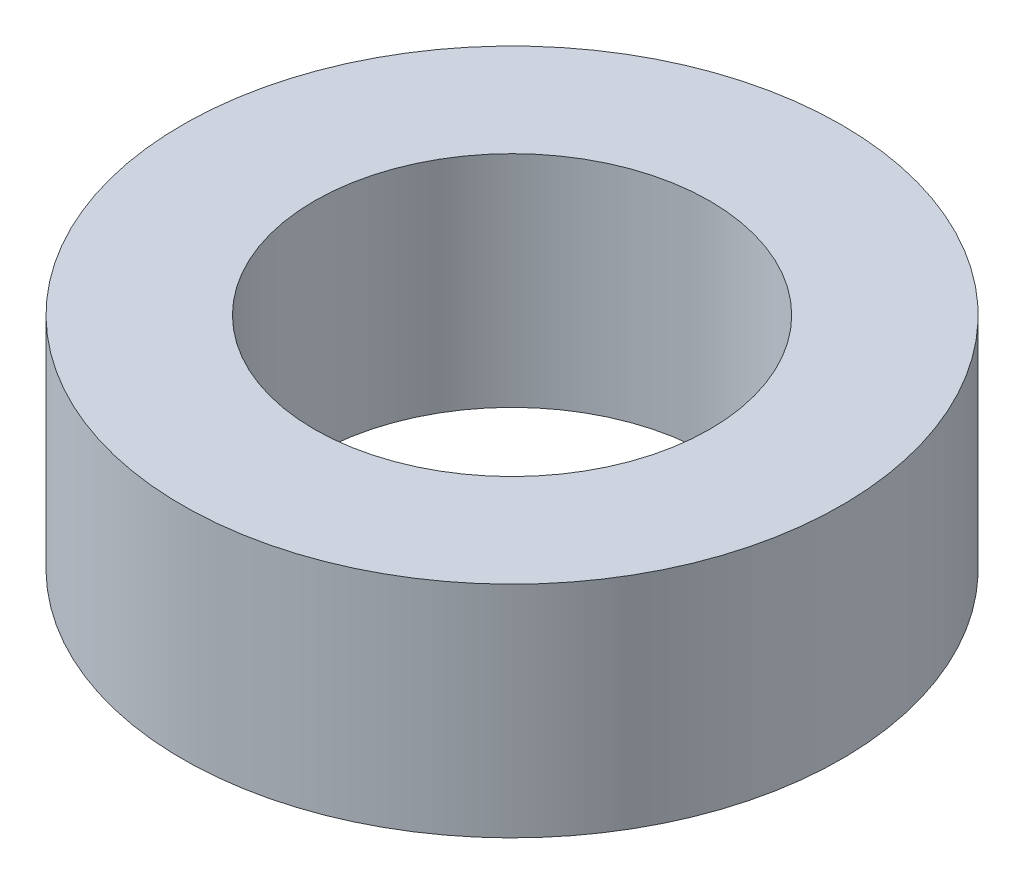
ISO-10303-21;
HEADER;
FILE_DESCRIPTION(('STEP AP214'),'2;1');
FILE_NAME('part.step','',(''),(''),'','','');
FILE_SCHEMA(('AUTOMOTIVE_DESIGN { 1 0 10303 214 1 1 1 1 }'));
ENDSEC;
DATA;
#1=APPLICATION_CONTEXT('core data for automotive mechanical design processes');
#2=APPLICATION_PROTOCOL_DEFINITION('international standard','automotive_design',2000,#1);
#3=PRODUCT_CONTEXT('',#1,'mechanical');
#4=PRODUCT('Part','Part','',(#3));
#5=PRODUCT_RELATED_PRODUCT_CATEGORY('part','',(#4));
#6=PRODUCT_DEFINITION_FORMATION('','',#4);
#7=PRODUCT_DEFINITION_CONTEXT('part definition',#1,'design');
#8=PRODUCT_DEFINITION('design','',#6,#7);
#9=PRODUCT_DEFINITION_SHAPE('','',#8);
#10=(LENGTH_UNIT() NAMED_UNIT(*) SI_UNIT(.MILLI.,.METRE.));
#11=(NAMED_UNIT(*) PLANE_ANGLE_UNIT() SI_UNIT($,.RADIAN.));
#12=(NAMED_UNIT(*) SI_UNIT($,.STERADIAN.) SOLID_ANGLE_UNIT());
#13=UNCERTAINTY_MEASURE_WITH_UNIT(LENGTH_MEASURE(1.E-05),#10,'distance_accuracy_value','');
#14=(GEOMETRIC_REPRESENTATION_CONTEXT(3) GLOBAL_UNCERTAINTY_ASSIGNED_CONTEXT((#13)) GLOBAL_UNIT_ASSIGNED_CONTEXT((#10,
#11,#12)) REPRESENTATION_CONTEXT('',''));
#15=CARTESIAN_POINT('',(0.,0.,0.));
#16=DIRECTION('',(0.,0.,1.));
#17=DIRECTION('',(1.,0.,0.));
#18=AXIS2_PLACEMENT_3D('',#15,#16,#17);
#19=CARTESIAN_POINT('',(0.,0.,0.));
#20=DIRECTION('',(0.,-1.,0.));
#21=DIRECTION('',(0.,0.,-1.));
#22=AXIS2_PLACEMENT_3D('',#19,#20,#21);
#23=CYLINDRICAL_SURFACE('',#22,7.5);
#24=CARTESIAN_POINT('',(0.,0.,0.));
#25=DIRECTION('',(0.,-1.,0.));
#26=DIRECTION('',(0.,0.,-1.));
#27=AXIS2_PLACEMENT_3D('',#24,#25,#26);
#28=CIRCLE('',#27,7.5);
#29=CARTESIAN_POINT('',(0.,0.,-7.5));
#30=VERTEX_POINT('',#29);
#31=EDGE_CURVE('E12',#30,#30,#28,.T.);
#32=ORIENTED_EDGE('',*,*,#31,.T.);
#33=EDGE_LOOP('',(#32));
#34=FACE_BOUND('',#33,.T.);
#35=CARTESIAN_POINT('',(0.,-5.,0.));
#36=DIRECTION('',(0.,-1.,0.));
#37=DIRECTION('',(0.,0.,-1.));
#38=AXIS2_PLACEMENT_3D('',#35,#36,#37);
#39=CIRCLE('',#38,7.5);
#40=CARTESIAN_POINT('',(0.,-5.,-7.5));
#41=VERTEX_POINT('',#40);
#42=EDGE_CURVE('E49',#41,#41,#39,.T.);
#43=ORIENTED_EDGE('',*,*,#42,.F.);
#44=EDGE_LOOP('',(#43));
#45=FACE_BOUND('',#44,.T.);
#46=ADVANCED_FACE('F43',(#34,#45),#23,.T.);
#47=CARTESIAN_POINT('',(0.,-5.,0.));
#48=DIRECTION('',(0.,1.,0.));
#49=DIRECTION('',(0.,0.,1.));
#50=AXIS2_PLACEMENT_3D('',#47,#48,#49);
#51=PLANE('',#50);
#52=CARTESIAN_POINT('',(0.,-5.,0.));
#53=DIRECTION('',(0.,-1.,0.));
#54=DIRECTION('',(0.,0.,-1.));
#55=AXIS2_PLACEMENT_3D('',#52,#53,#54);
#56=CIRCLE('',#55,4.5);
#57=CARTESIAN_POINT('',(0.,-5.,-4.5));
#58=VERTEX_POINT('',#57);
#59=EDGE_CURVE('E53',#58,#58,#56,.T.);
#60=ORIENTED_EDGE('',*,*,#59,.F.);
#61=EDGE_LOOP('',(#60));
#62=FACE_BOUND('',#61,.T.);
#63=ORIENTED_EDGE('',*,*,#42,.T.);
#64=EDGE_LOOP('',(#63));
#65=FACE_BOUND('',#64,.T.);
#66=ADVANCED_FACE('F69',(#62,#65),#51,.F.);
#67=CARTESIAN_POINT('',(0.,0.,0.));
#68=DIRECTION('',(0.,-1.,0.));
#69=DIRECTION('',(0.,0.,-1.));
#70=AXIS2_PLACEMENT_3D('',#67,#68,#69);
#71=CYLINDRICAL_SURFACE('',#70,4.5);
#72=CARTESIAN_POINT('',(0.,0.,0.));
#73=DIRECTION('',(0.,-1.,0.));
#74=DIRECTION('',(0.,0.,-1.));
#75=AXIS2_PLACEMENT_3D('',#72,#73,#74);
#76=CIRCLE('',#75,4.5);
#77=CARTESIAN_POINT('',(0.,0.,-4.5));
#78=VERTEX_POINT('',#77);
#79=EDGE_CURVE('E57',#78,#78,#76,.T.);
#80=ORIENTED_EDGE('',*,*,#79,.F.);
#81=EDGE_LOOP('',(#80));
#82=FACE_BOUND('',#81,.T.);
#83=ORIENTED_EDGE('',*,*,#59,.T.);
#84=EDGE_LOOP('',(#83));
#85=FACE_BOUND('',#84,.T.);
#86=ADVANCED_FACE('F66',(#82,#85),#71,.F.);
#87=CARTESIAN_POINT('',(-15.5,0.,7.5));
#88=DIRECTION('',(0.,-1.,0.));
#89=DIRECTION('',(0.,0.,-1.));
#90=AXIS2_PLACEMENT_3D('',#87,#88,#89);
#91=PLANE('',#90);
#92=ORIENTED_EDGE('',*,*,#79,.T.);
#93=EDGE_LOOP('',(#92));
#94=FACE_BOUND('',#93,.T.);
#95=ORIENTED_EDGE('',*,*,#31,.F.);
#96=EDGE_LOOP('',(#95));
#97=FACE_BOUND('',#96,.T.);
#98=ADVANCED_FACE('F63',(#94,#97),#91,.F.);
#99=CLOSED_SHELL('',(#46,#66,#86,#98));
#100=MANIFOLD_SOLID_BREP('B2',#99);
#101=ADVANCED_BREP_SHAPE_REPRESENTATION('',(#18,#100),#14);
#102=SHAPE_DEFINITION_REPRESENTATION(#9,#101);
ENDSEC;
END-ISO-10303-21;
